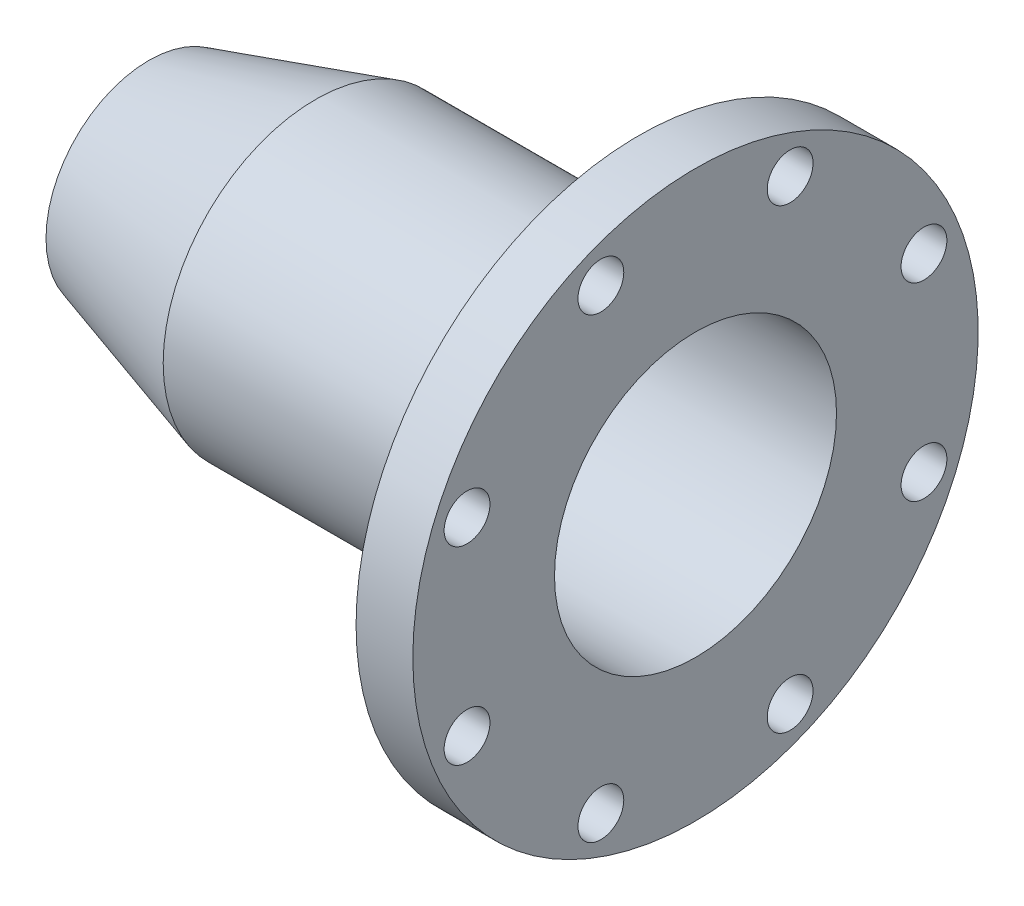
ISO-10303-21;
HEADER;
FILE_DESCRIPTION(('STEP AP214'),'2;1');
FILE_NAME('part.step','',(''),(''),'','','');
FILE_SCHEMA(('AUTOMOTIVE_DESIGN { 1 0 10303 214 1 1 1 1 }'));
ENDSEC;
DATA;
#1=APPLICATION_CONTEXT('core data for automotive mechanical design processes');
#2=APPLICATION_PROTOCOL_DEFINITION('international standard','automotive_design',2000,#1);
#3=PRODUCT_CONTEXT('',#1,'mechanical');
#4=PRODUCT('Part','Part','',(#3));
#5=PRODUCT_RELATED_PRODUCT_CATEGORY('part','',(#4));
#6=PRODUCT_DEFINITION_FORMATION('','',#4);
#7=PRODUCT_DEFINITION_CONTEXT('part definition',#1,'design');
#8=PRODUCT_DEFINITION('design','',#6,#7);
#9=PRODUCT_DEFINITION_SHAPE('','',#8);
#10=(LENGTH_UNIT() NAMED_UNIT(*) SI_UNIT(.MILLI.,.METRE.));
#11=(NAMED_UNIT(*) PLANE_ANGLE_UNIT() SI_UNIT($,.RADIAN.));
#12=(NAMED_UNIT(*) SI_UNIT($,.STERADIAN.) SOLID_ANGLE_UNIT());
#13=UNCERTAINTY_MEASURE_WITH_UNIT(LENGTH_MEASURE(1.E-05),#10,'distance_accuracy_value','');
#14=(GEOMETRIC_REPRESENTATION_CONTEXT(3) GLOBAL_UNCERTAINTY_ASSIGNED_CONTEXT((#13)) GLOBAL_UNIT_ASSIGNED_CONTEXT((#10,
#11,#12)) REPRESENTATION_CONTEXT('',''));
#15=CARTESIAN_POINT('',(0.,0.,0.));
#16=DIRECTION('',(0.,0.,1.));
#17=DIRECTION('',(1.,0.,0.));
#18=AXIS2_PLACEMENT_3D('',#15,#16,#17);
#19=CARTESIAN_POINT('',(0.,0.,0.));
#20=DIRECTION('',(-1.,0.,0.));
#21=DIRECTION('',(0.,0.,1.));
#22=AXIS2_PLACEMENT_3D('',#19,#20,#21);
#23=CYLINDRICAL_SURFACE('',#22,74.295);
#24=CARTESIAN_POINT('',(239.01,0.,0.));
#25=DIRECTION('',(-1.,0.,0.));
#26=DIRECTION('',(0.,0.,1.));
#27=AXIS2_PLACEMENT_3D('',#24,#25,#26);
#28=CIRCLE('',#27,74.295);
#29=CARTESIAN_POINT('',(239.01,0.,74.295));
#30=VERTEX_POINT('',#29);
#31=EDGE_CURVE('E95',#30,#30,#28,.T.);
#32=ORIENTED_EDGE('',*,*,#31,.T.);
#33=EDGE_LOOP('',(#32));
#34=FACE_BOUND('',#33,.T.);
#35=CARTESIAN_POINT('',(81.28,0.,0.));
#36=DIRECTION('',(-1.,0.,0.));
#37=DIRECTION('',(0.,0.,1.));
#38=AXIS2_PLACEMENT_3D('',#35,#36,#37);
#39=CIRCLE('',#38,74.295);
#40=CARTESIAN_POINT('',(81.28,0.,74.295));
#41=VERTEX_POINT('',#40);
#42=EDGE_CURVE('E10',#41,#41,#39,.T.);
#43=ORIENTED_EDGE('',*,*,#42,.F.);
#44=EDGE_LOOP('',(#43));
#45=FACE_BOUND('',#44,.T.);
#46=ADVANCED_FACE('F36',(#34,#45),#23,.T.);
#47=CARTESIAN_POINT('',(81.28,0.,0.));
#48=DIRECTION('',(1.,0.,0.));
#49=DIRECTION('',(0.,0.,-1.));
#50=AXIS2_PLACEMENT_3D('',#47,#48,#49);
#51=CONICAL_SURFACE('',#50,74.295,0.288340484549115);
#52=CARTESIAN_POINT('',(0.,0.,0.));
#53=DIRECTION('',(-1.,0.,0.));
#54=DIRECTION('',(0.,0.,1.));
#55=AXIS2_PLACEMENT_3D('',#52,#53,#54);
#56=CIRCLE('',#55,50.1868331198608);
#57=CARTESIAN_POINT('',(0.,0.,50.1868331198608));
#58=VERTEX_POINT('',#57);
#59=EDGE_CURVE('E43',#58,#58,#56,.T.);
#60=ORIENTED_EDGE('',*,*,#59,.F.);
#61=EDGE_LOOP('',(#60));
#62=FACE_BOUND('',#61,.T.);
#63=ORIENTED_EDGE('',*,*,#42,.T.);
#64=EDGE_LOOP('',(#63));
#65=FACE_BOUND('',#64,.T.);
#66=ADVANCED_FACE('F118',(#62,#65),#51,.T.);
#67=CARTESIAN_POINT('',(0.,0.,0.));
#68=DIRECTION('',(1.,0.,0.));
#69=DIRECTION('',(0.,0.,-1.));
#70=AXIS2_PLACEMENT_3D('',#67,#68,#69);
#71=PLANE('',#70);
#72=CARTESIAN_POINT('',(0.,0.,0.));
#73=DIRECTION('',(-1.,0.,0.));
#74=DIRECTION('',(0.,0.,1.));
#75=AXIS2_PLACEMENT_3D('',#72,#73,#74);
#76=CIRCLE('',#75,44.45);
#77=CARTESIAN_POINT('',(0.,0.,44.45));
#78=VERTEX_POINT('',#77);
#79=EDGE_CURVE('E48',#78,#78,#76,.T.);
#80=ORIENTED_EDGE('',*,*,#79,.F.);
#81=EDGE_LOOP('',(#80));
#82=FACE_BOUND('',#81,.T.);
#83=ORIENTED_EDGE('',*,*,#59,.T.);
#84=EDGE_LOOP('',(#83));
#85=FACE_BOUND('',#84,.T.);
#86=ADVANCED_FACE('F115',(#82,#85),#71,.F.);
#87=CARTESIAN_POINT('',(82.0784761378992,0.,0.));
#88=DIRECTION('',(1.,0.,0.));
#89=DIRECTION('',(0.,0.,-1.));
#90=AXIS2_PLACEMENT_3D('',#87,#88,#89);
#91=CONICAL_SURFACE('',#90,68.795,0.288340484549115);
#92=ORIENTED_EDGE('',*,*,#79,.T.);
#93=EDGE_LOOP('',(#92));
#94=FACE_BOUND('',#93,.T.);
#95=CARTESIAN_POINT('',(82.0784761378992,0.,0.));
#96=DIRECTION('',(-1.,0.,0.));
#97=DIRECTION('',(0.,0.,1.));
#98=AXIS2_PLACEMENT_3D('',#95,#96,#97);
#99=CIRCLE('',#98,68.795);
#100=CARTESIAN_POINT('',(82.0784761378992,0.,68.795));
#101=VERTEX_POINT('',#100);
#102=EDGE_CURVE('E107',#101,#101,#99,.T.);
#103=ORIENTED_EDGE('',*,*,#102,.F.);
#104=EDGE_LOOP('',(#103));
#105=FACE_BOUND('',#104,.T.);
#106=ADVANCED_FACE('F112',(#94,#105),#91,.F.);
#107=CARTESIAN_POINT('',(0.,0.,0.));
#108=DIRECTION('',(-1.,0.,0.));
#109=DIRECTION('',(0.,0.,1.));
#110=AXIS2_PLACEMENT_3D('',#107,#108,#109);
#111=CYLINDRICAL_SURFACE('',#110,68.795);
#112=ORIENTED_EDGE('',*,*,#102,.T.);
#113=EDGE_LOOP('',(#112));
#114=FACE_BOUND('',#113,.T.);
#115=CARTESIAN_POINT('',(266.7,0.,0.));
#116=DIRECTION('',(-1.,0.,0.));
#117=DIRECTION('',(0.,0.,1.));
#118=AXIS2_PLACEMENT_3D('',#115,#116,#117);
#119=CIRCLE('',#118,68.795);
#120=CARTESIAN_POINT('',(266.7,0.,68.795));
#121=VERTEX_POINT('',#120);
#122=EDGE_CURVE('E104',#121,#121,#119,.T.);
#123=ORIENTED_EDGE('',*,*,#122,.F.);
#124=EDGE_LOOP('',(#123));
#125=FACE_BOUND('',#124,.T.);
#126=ADVANCED_FACE('F130',(#114,#125),#111,.F.);
#127=CARTESIAN_POINT('',(266.7,2.141746695606E-13,0.));
#128=DIRECTION('',(-1.,0.,0.));
#129=DIRECTION('',(0.,0.,1.));
#130=AXIS2_PLACEMENT_3D('',#127,#128,#129);
#131=PLANE('',#130);
#132=CARTESIAN_POINT('',(266.7,46.1707561148491,111.466065597486));
#133=DIRECTION('',(1.,0.,0.));
#134=DIRECTION('',(0.,0.,-1.));
#135=AXIS2_PLACEMENT_3D('',#132,#133,#134);
#136=CIRCLE('',#135,11.176);
#137=CARTESIAN_POINT('',(266.7,46.1707561148491,100.290065597486));
#138=VERTEX_POINT('',#137);
#139=EDGE_CURVE('E181',#138,#138,#136,.T.);
#140=ORIENTED_EDGE('',*,*,#139,.F.);
#141=EDGE_LOOP('',(#140));
#142=FACE_BOUND('',#141,.T.);
#143=CARTESIAN_POINT('',(266.7,-46.1707561148473,111.466065597487));
#144=DIRECTION('',(1.,0.,0.));
#145=DIRECTION('',(0.,0.,-1.));
#146=AXIS2_PLACEMENT_3D('',#143,#144,#145);
#147=CIRCLE('',#146,11.176);
#148=CARTESIAN_POINT('',(266.7,-46.1707561148473,100.290065597487));
#149=VERTEX_POINT('',#148);
#150=EDGE_CURVE('E78',#149,#149,#147,.T.);
#151=ORIENTED_EDGE('',*,*,#150,.F.);
#152=EDGE_LOOP('',(#151));
#153=FACE_BOUND('',#152,.T.);
#154=CARTESIAN_POINT('',(266.7,-111.466065597486,46.1707561148487));
#155=DIRECTION('',(1.,0.,0.));
#156=DIRECTION('',(0.,0.,-1.));
#157=AXIS2_PLACEMENT_3D('',#154,#155,#156);
#158=CIRCLE('',#157,11.176);
#159=CARTESIAN_POINT('',(266.7,-111.466065597486,34.9947561148488));
#160=VERTEX_POINT('',#159);
#161=EDGE_CURVE('E67',#160,#160,#158,.T.);
#162=ORIENTED_EDGE('',*,*,#161,.F.);
#163=EDGE_LOOP('',(#162));
#164=FACE_BOUND('',#163,.T.);
#165=CARTESIAN_POINT('',(266.7,-111.466065597487,-46.1707561148476));
#166=DIRECTION('',(1.,0.,0.));
#167=DIRECTION('',(0.,0.,-1.));
#168=AXIS2_PLACEMENT_3D('',#165,#166,#167);
#169=CIRCLE('',#168,11.176);
#170=CARTESIAN_POINT('',(266.7,-111.466065597487,-57.3467561148475));
#171=VERTEX_POINT('',#170);
#172=EDGE_CURVE('E66',#171,#171,#169,.T.);
#173=ORIENTED_EDGE('',*,*,#172,.F.);
#174=EDGE_LOOP('',(#173));
#175=FACE_BOUND('',#174,.T.);
#176=CARTESIAN_POINT('',(266.7,-46.1707561148484,-111.466065597487));
#177=DIRECTION('',(1.,0.,0.));
#178=DIRECTION('',(0.,0.,-1.));
#179=AXIS2_PLACEMENT_3D('',#176,#177,#178);
#180=CIRCLE('',#179,11.176);
#181=CARTESIAN_POINT('',(266.7,-46.1707561148484,-122.642065597487));
#182=VERTEX_POINT('',#181);
#183=EDGE_CURVE('E63',#182,#182,#180,.T.);
#184=ORIENTED_EDGE('',*,*,#183,.F.);
#185=EDGE_LOOP('',(#184));
#186=FACE_BOUND('',#185,.T.);
#187=CARTESIAN_POINT('',(266.7,46.1707561148479,-111.466065597487));
#188=DIRECTION('',(1.,0.,0.));
#189=DIRECTION('',(0.,0.,-1.));
#190=AXIS2_PLACEMENT_3D('',#187,#188,#189);
#191=CIRCLE('',#190,11.176);
#192=CARTESIAN_POINT('',(266.7,46.1707561148479,-122.642065597487));
#193=VERTEX_POINT('',#192);
#194=EDGE_CURVE('E60',#193,#193,#191,.T.);
#195=ORIENTED_EDGE('',*,*,#194,.F.);
#196=EDGE_LOOP('',(#195));
#197=FACE_BOUND('',#196,.T.);
#198=CARTESIAN_POINT('',(266.7,111.466065597487,-46.1707561148481));
#199=DIRECTION('',(1.,0.,0.));
#200=DIRECTION('',(0.,0.,-1.));
#201=AXIS2_PLACEMENT_3D('',#198,#199,#200);
#202=CIRCLE('',#201,11.176);
#203=CARTESIAN_POINT('',(266.7,111.466065597487,-57.3467561148481));
#204=VERTEX_POINT('',#203);
#205=EDGE_CURVE('E56',#204,#204,#202,.T.);
#206=ORIENTED_EDGE('',*,*,#205,.F.);
#207=EDGE_LOOP('',(#206));
#208=FACE_BOUND('',#207,.T.);
#209=CARTESIAN_POINT('',(266.7,111.466065597487,46.1707561148482));
#210=DIRECTION('',(1.,0.,0.));
#211=DIRECTION('',(0.,0.,-1.));
#212=AXIS2_PLACEMENT_3D('',#209,#210,#211);
#213=CIRCLE('',#212,11.176);
#214=CARTESIAN_POINT('',(266.7,111.466065597487,34.9947561148482));
#215=VERTEX_POINT('',#214);
#216=EDGE_CURVE('E55',#215,#215,#213,.T.);
#217=ORIENTED_EDGE('',*,*,#216,.F.);
#218=EDGE_LOOP('',(#217));
#219=FACE_BOUND('',#218,.T.);
#220=CARTESIAN_POINT('',(266.7,0.,0.));
#221=DIRECTION('',(-1.,0.,0.));
#222=DIRECTION('',(0.,0.,1.));
#223=AXIS2_PLACEMENT_3D('',#220,#221,#222);
#224=CIRCLE('',#223,137.92);
#225=CARTESIAN_POINT('',(266.7,0.,137.92));
#226=VERTEX_POINT('',#225);
#227=EDGE_CURVE('E101',#226,#226,#224,.T.);
#228=ORIENTED_EDGE('',*,*,#227,.F.);
#229=EDGE_LOOP('',(#228));
#230=FACE_BOUND('',#229,.T.);
#231=ORIENTED_EDGE('',*,*,#122,.T.);
#232=EDGE_LOOP('',(#231));
#233=FACE_BOUND('',#232,.T.);
#234=ADVANCED_FACE('F133',(#142,#153,#164,#175,#186,#197,#208,#219,#230,#233),#131,.F.);
#235=CARTESIAN_POINT('',(0.,0.,0.));
#236=DIRECTION('',(-1.,0.,0.));
#237=DIRECTION('',(0.,0.,1.));
#238=AXIS2_PLACEMENT_3D('',#235,#236,#237);
#239=CYLINDRICAL_SURFACE('',#238,137.92);
#240=CARTESIAN_POINT('',(239.01,0.,0.));
#241=DIRECTION('',(-1.,0.,0.));
#242=DIRECTION('',(0.,0.,1.));
#243=AXIS2_PLACEMENT_3D('',#240,#241,#242);
#244=CIRCLE('',#243,137.92);
#245=CARTESIAN_POINT('',(239.01,0.,137.92));
#246=VERTEX_POINT('',#245);
#247=EDGE_CURVE('E98',#246,#246,#244,.T.);
#248=ORIENTED_EDGE('',*,*,#247,.F.);
#249=EDGE_LOOP('',(#248));
#250=FACE_BOUND('',#249,.T.);
#251=ORIENTED_EDGE('',*,*,#227,.T.);
#252=EDGE_LOOP('',(#251));
#253=FACE_BOUND('',#252,.T.);
#254=ADVANCED_FACE('F137',(#250,#253),#239,.T.);
#255=CARTESIAN_POINT('',(239.01,1.04264992186899E-13,0.));
#256=DIRECTION('',(1.,0.,0.));
#257=DIRECTION('',(0.,0.,-1.));
#258=AXIS2_PLACEMENT_3D('',#255,#256,#257);
#259=PLANE('',#258);
#260=CARTESIAN_POINT('',(239.01,46.1707561148491,111.466065597486));
#261=DIRECTION('',(1.,0.,0.));
#262=DIRECTION('',(0.,0.,-1.));
#263=AXIS2_PLACEMENT_3D('',#260,#261,#262);
#264=CIRCLE('',#263,11.176);
#265=CARTESIAN_POINT('',(239.01,46.1707561148491,100.290065597486));
#266=VERTEX_POINT('',#265);
#267=EDGE_CURVE('E184',#266,#266,#264,.T.);
#268=ORIENTED_EDGE('',*,*,#267,.T.);
#269=EDGE_LOOP('',(#268));
#270=FACE_BOUND('',#269,.T.);
#271=CARTESIAN_POINT('',(239.01,-46.1707561148473,111.466065597487));
#272=DIRECTION('',(1.,0.,0.));
#273=DIRECTION('',(0.,0.,-1.));
#274=AXIS2_PLACEMENT_3D('',#271,#272,#273);
#275=CIRCLE('',#274,11.176);
#276=CARTESIAN_POINT('',(239.01,-46.1707561148473,100.290065597487));
#277=VERTEX_POINT('',#276);
#278=EDGE_CURVE('E39',#277,#277,#275,.T.);
#279=ORIENTED_EDGE('',*,*,#278,.T.);
#280=EDGE_LOOP('',(#279));
#281=FACE_BOUND('',#280,.T.);
#282=CARTESIAN_POINT('',(239.01,-111.466065597486,46.1707561148487));
#283=DIRECTION('',(1.,0.,0.));
#284=DIRECTION('',(0.,0.,-1.));
#285=AXIS2_PLACEMENT_3D('',#282,#283,#284);
#286=CIRCLE('',#285,11.176);
#287=CARTESIAN_POINT('',(239.01,-111.466065597486,34.9947561148488));
#288=VERTEX_POINT('',#287);
#289=EDGE_CURVE('E64',#288,#288,#286,.T.);
#290=ORIENTED_EDGE('',*,*,#289,.T.);
#291=EDGE_LOOP('',(#290));
#292=FACE_BOUND('',#291,.T.);
#293=CARTESIAN_POINT('',(239.01,-111.466065597487,-46.1707561148476));
#294=DIRECTION('',(1.,0.,0.));
#295=DIRECTION('',(0.,0.,-1.));
#296=AXIS2_PLACEMENT_3D('',#293,#294,#295);
#297=CIRCLE('',#296,11.176);
#298=CARTESIAN_POINT('',(239.01,-111.466065597487,-57.3467561148475));
#299=VERTEX_POINT('',#298);
#300=EDGE_CURVE('E71',#299,#299,#297,.T.);
#301=ORIENTED_EDGE('',*,*,#300,.T.);
#302=EDGE_LOOP('',(#301));
#303=FACE_BOUND('',#302,.T.);
#304=CARTESIAN_POINT('',(239.01,-46.1707561148484,-111.466065597487));
#305=DIRECTION('',(1.,0.,0.));
#306=DIRECTION('',(0.,0.,-1.));
#307=AXIS2_PLACEMENT_3D('',#304,#305,#306);
#308=CIRCLE('',#307,11.176);
#309=CARTESIAN_POINT('',(239.01,-46.1707561148484,-122.642065597487));
#310=VERTEX_POINT('',#309);
#311=EDGE_CURVE('E61',#310,#310,#308,.T.);
#312=ORIENTED_EDGE('',*,*,#311,.T.);
#313=EDGE_LOOP('',(#312));
#314=FACE_BOUND('',#313,.T.);
#315=CARTESIAN_POINT('',(239.01,46.1707561148479,-111.466065597487));
#316=DIRECTION('',(1.,0.,0.));
#317=DIRECTION('',(0.,0.,-1.));
#318=AXIS2_PLACEMENT_3D('',#315,#316,#317);
#319=CIRCLE('',#318,11.176);
#320=CARTESIAN_POINT('',(239.01,46.1707561148479,-122.642065597487));
#321=VERTEX_POINT('',#320);
#322=EDGE_CURVE('E57',#321,#321,#319,.T.);
#323=ORIENTED_EDGE('',*,*,#322,.T.);
#324=EDGE_LOOP('',(#323));
#325=FACE_BOUND('',#324,.T.);
#326=CARTESIAN_POINT('',(239.01,111.466065597487,-46.1707561148481));
#327=DIRECTION('',(1.,0.,0.));
#328=DIRECTION('',(0.,0.,-1.));
#329=AXIS2_PLACEMENT_3D('',#326,#327,#328);
#330=CIRCLE('',#329,11.176);
#331=CARTESIAN_POINT('',(239.01,111.466065597487,-57.3467561148481));
#332=VERTEX_POINT('',#331);
#333=EDGE_CURVE('E52',#332,#332,#330,.T.);
#334=ORIENTED_EDGE('',*,*,#333,.T.);
#335=EDGE_LOOP('',(#334));
#336=FACE_BOUND('',#335,.T.);
#337=CARTESIAN_POINT('',(239.01,111.466065597487,46.1707561148482));
#338=DIRECTION('',(1.,0.,0.));
#339=DIRECTION('',(0.,0.,-1.));
#340=AXIS2_PLACEMENT_3D('',#337,#338,#339);
#341=CIRCLE('',#340,11.176);
#342=CARTESIAN_POINT('',(239.01,111.466065597487,34.9947561148482));
#343=VERTEX_POINT('',#342);
#344=EDGE_CURVE('E92',#343,#343,#341,.T.);
#345=ORIENTED_EDGE('',*,*,#344,.T.);
#346=EDGE_LOOP('',(#345));
#347=FACE_BOUND('',#346,.T.);
#348=ORIENTED_EDGE('',*,*,#31,.F.);
#349=EDGE_LOOP('',(#348));
#350=FACE_BOUND('',#349,.T.);
#351=ORIENTED_EDGE('',*,*,#247,.T.);
#352=EDGE_LOOP('',(#351));
#353=FACE_BOUND('',#352,.T.);
#354=ADVANCED_FACE('F141',(#270,#281,#292,#303,#314,#325,#336,#347,#350,#353),#259,.F.);
#355=CARTESIAN_POINT('',(266.7,111.466065597487,46.1707561148482));
#356=DIRECTION('',(1.,0.,0.));
#357=DIRECTION('',(0.,0.,-1.));
#358=AXIS2_PLACEMENT_3D('',#355,#356,#357);
#359=CYLINDRICAL_SURFACE('',#358,11.176);
#360=ORIENTED_EDGE('',*,*,#216,.T.);
#361=EDGE_LOOP('',(#360));
#362=FACE_BOUND('',#361,.T.);
#363=ORIENTED_EDGE('',*,*,#344,.F.);
#364=EDGE_LOOP('',(#363));
#365=FACE_BOUND('',#364,.T.);
#366=ADVANCED_FACE('F145',(#362,#365),#359,.F.);
#367=CARTESIAN_POINT('',(266.7,111.466065597487,-46.1707561148481));
#368=DIRECTION('',(1.,0.,0.));
#369=DIRECTION('',(0.,0.,-1.));
#370=AXIS2_PLACEMENT_3D('',#367,#368,#369);
#371=CYLINDRICAL_SURFACE('',#370,11.176);
#372=ORIENTED_EDGE('',*,*,#205,.T.);
#373=EDGE_LOOP('',(#372));
#374=FACE_BOUND('',#373,.T.);
#375=ORIENTED_EDGE('',*,*,#333,.F.);
#376=EDGE_LOOP('',(#375));
#377=FACE_BOUND('',#376,.T.);
#378=ADVANCED_FACE('F149',(#374,#377),#371,.F.);
#379=CARTESIAN_POINT('',(266.7,46.1707561148479,-111.466065597487));
#380=DIRECTION('',(1.,0.,0.));
#381=DIRECTION('',(0.,0.,-1.));
#382=AXIS2_PLACEMENT_3D('',#379,#380,#381);
#383=CYLINDRICAL_SURFACE('',#382,11.176);
#384=ORIENTED_EDGE('',*,*,#194,.T.);
#385=EDGE_LOOP('',(#384));
#386=FACE_BOUND('',#385,.T.);
#387=ORIENTED_EDGE('',*,*,#322,.F.);
#388=EDGE_LOOP('',(#387));
#389=FACE_BOUND('',#388,.T.);
#390=ADVANCED_FACE('F153',(#386,#389),#383,.F.);
#391=CARTESIAN_POINT('',(266.7,-46.1707561148484,-111.466065597487));
#392=DIRECTION('',(1.,0.,0.));
#393=DIRECTION('',(0.,0.,-1.));
#394=AXIS2_PLACEMENT_3D('',#391,#392,#393);
#395=CYLINDRICAL_SURFACE('',#394,11.176);
#396=ORIENTED_EDGE('',*,*,#183,.T.);
#397=EDGE_LOOP('',(#396));
#398=FACE_BOUND('',#397,.T.);
#399=ORIENTED_EDGE('',*,*,#311,.F.);
#400=EDGE_LOOP('',(#399));
#401=FACE_BOUND('',#400,.T.);
#402=ADVANCED_FACE('F157',(#398,#401),#395,.F.);
#403=CARTESIAN_POINT('',(266.7,-111.466065597487,-46.1707561148476));
#404=DIRECTION('',(1.,0.,0.));
#405=DIRECTION('',(0.,0.,-1.));
#406=AXIS2_PLACEMENT_3D('',#403,#404,#405);
#407=CYLINDRICAL_SURFACE('',#406,11.176);
#408=ORIENTED_EDGE('',*,*,#172,.T.);
#409=EDGE_LOOP('',(#408));
#410=FACE_BOUND('',#409,.T.);
#411=ORIENTED_EDGE('',*,*,#300,.F.);
#412=EDGE_LOOP('',(#411));
#413=FACE_BOUND('',#412,.T.);
#414=ADVANCED_FACE('F161',(#410,#413),#407,.F.);
#415=CARTESIAN_POINT('',(266.7,-111.466065597486,46.1707561148487));
#416=DIRECTION('',(1.,0.,0.));
#417=DIRECTION('',(0.,0.,-1.));
#418=AXIS2_PLACEMENT_3D('',#415,#416,#417);
#419=CYLINDRICAL_SURFACE('',#418,11.176);
#420=ORIENTED_EDGE('',*,*,#161,.T.);
#421=EDGE_LOOP('',(#420));
#422=FACE_BOUND('',#421,.T.);
#423=ORIENTED_EDGE('',*,*,#289,.F.);
#424=EDGE_LOOP('',(#423));
#425=FACE_BOUND('',#424,.T.);
#426=ADVANCED_FACE('F165',(#422,#425),#419,.F.);
#427=CARTESIAN_POINT('',(266.7,-46.1707561148473,111.466065597487));
#428=DIRECTION('',(1.,0.,0.));
#429=DIRECTION('',(0.,0.,-1.));
#430=AXIS2_PLACEMENT_3D('',#427,#428,#429);
#431=CYLINDRICAL_SURFACE('',#430,11.176);
#432=ORIENTED_EDGE('',*,*,#150,.T.);
#433=EDGE_LOOP('',(#432));
#434=FACE_BOUND('',#433,.T.);
#435=ORIENTED_EDGE('',*,*,#278,.F.);
#436=EDGE_LOOP('',(#435));
#437=FACE_BOUND('',#436,.T.);
#438=ADVANCED_FACE('F169',(#434,#437),#431,.F.);
#439=CARTESIAN_POINT('',(266.7,46.1707561148491,111.466065597486));
#440=DIRECTION('',(1.,0.,0.));
#441=DIRECTION('',(0.,0.,-1.));
#442=AXIS2_PLACEMENT_3D('',#439,#440,#441);
#443=CYLINDRICAL_SURFACE('',#442,11.176);
#444=ORIENTED_EDGE('',*,*,#139,.T.);
#445=EDGE_LOOP('',(#444));
#446=FACE_BOUND('',#445,.T.);
#447=ORIENTED_EDGE('',*,*,#267,.F.);
#448=EDGE_LOOP('',(#447));
#449=FACE_BOUND('',#448,.T.);
#450=ADVANCED_FACE('F172',(#446,#449),#443,.F.);
#451=CLOSED_SHELL('',(#46,#66,#86,#106,#126,#234,#254,#354,#366,#378,#390,#402,#414,#426,#438,#450));
#452=MANIFOLD_SOLID_BREP('B2',#451);
#453=ADVANCED_BREP_SHAPE_REPRESENTATION('',(#18,#452),#14);
#454=SHAPE_DEFINITION_REPRESENTATION(#9,#453);
ENDSEC;
END-ISO-10303-21;
